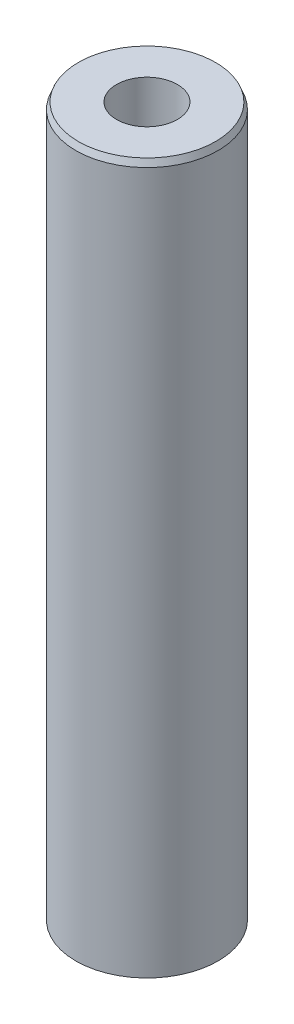
ISO-10303-21;
HEADER;
FILE_DESCRIPTION(('STEP AP214'),'2;1');
FILE_NAME('part.step','',(''),(''),'','','');
FILE_SCHEMA(('AUTOMOTIVE_DESIGN { 1 0 10303 214 1 1 1 1 }'));
ENDSEC;
DATA;
#1=APPLICATION_CONTEXT('core data for automotive mechanical design processes');
#2=APPLICATION_PROTOCOL_DEFINITION('international standard','automotive_design',2000,#1);
#3=PRODUCT_CONTEXT('',#1,'mechanical');
#4=PRODUCT('Part','Part','',(#3));
#5=PRODUCT_RELATED_PRODUCT_CATEGORY('part','',(#4));
#6=PRODUCT_DEFINITION_FORMATION('','',#4);
#7=PRODUCT_DEFINITION_CONTEXT('part definition',#1,'design');
#8=PRODUCT_DEFINITION('design','',#6,#7);
#9=PRODUCT_DEFINITION_SHAPE('','',#8);
#10=(LENGTH_UNIT() NAMED_UNIT(*) SI_UNIT(.MILLI.,.METRE.));
#11=(NAMED_UNIT(*) PLANE_ANGLE_UNIT() SI_UNIT($,.RADIAN.));
#12=(NAMED_UNIT(*) SI_UNIT($,.STERADIAN.) SOLID_ANGLE_UNIT());
#13=UNCERTAINTY_MEASURE_WITH_UNIT(LENGTH_MEASURE(1.E-05),#10,'distance_accuracy_value','');
#14=(GEOMETRIC_REPRESENTATION_CONTEXT(3) GLOBAL_UNCERTAINTY_ASSIGNED_CONTEXT((#13)) GLOBAL_UNIT_ASSIGNED_CONTEXT((#10,
#11,#12)) REPRESENTATION_CONTEXT('',''));
#15=CARTESIAN_POINT('',(0.,0.,0.));
#16=DIRECTION('',(0.,0.,1.));
#17=DIRECTION('',(1.,0.,0.));
#18=AXIS2_PLACEMENT_3D('',#15,#16,#17);
#19=CARTESIAN_POINT('',(0.,600.,0.));
#20=DIRECTION('',(0.,-1.,0.));
#21=DIRECTION('',(0.,0.,-1.));
#22=AXIS2_PLACEMENT_3D('',#19,#20,#21);
#23=CYLINDRICAL_SURFACE('',#22,60.);
#24=CARTESIAN_POINT('',(0.,594.459157099144,0.));
#25=DIRECTION('',(0.,1.,0.));
#26=DIRECTION('',(0.,0.,1.));
#27=AXIS2_PLACEMENT_3D('',#24,#25,#26);
#28=CIRCLE('',#27,60.);
#29=CARTESIAN_POINT('',(0.,594.459157099144,60.));
#30=VERTEX_POINT('',#29);
#31=EDGE_CURVE('E50',#30,#30,#28,.F.);
#32=ORIENTED_EDGE('',*,*,#31,.T.);
#33=EDGE_LOOP('',(#32));
#34=FACE_BOUND('',#33,.T.);
#35=CARTESIAN_POINT('',(0.,2.12822243041655,0.));
#36=DIRECTION('',(0.,1.,0.));
#37=DIRECTION('',(0.,0.,1.));
#38=AXIS2_PLACEMENT_3D('',#35,#36,#37);
#39=CIRCLE('',#38,60.);
#40=CARTESIAN_POINT('',(0.,2.12822243041655,60.));
#41=VERTEX_POINT('',#40);
#42=EDGE_CURVE('E51',#41,#41,#39,.T.);
#43=ORIENTED_EDGE('',*,*,#42,.T.);
#44=EDGE_LOOP('',(#43));
#45=FACE_BOUND('',#44,.T.);
#46=ADVANCED_FACE('F39',(#34,#45),#23,.T.);
#47=CARTESIAN_POINT('',(0.,600.,0.));
#48=DIRECTION('',(0.,1.,0.));
#49=DIRECTION('',(0.,0.,1.));
#50=AXIS2_PLACEMENT_3D('',#47,#48,#49);
#51=PLANE('',#50);
#52=CARTESIAN_POINT('',(0.,600.,0.));
#53=DIRECTION('',(0.,1.,0.));
#54=DIRECTION('',(0.,0.,1.));
#55=AXIS2_PLACEMENT_3D('',#52,#53,#54);
#56=CIRCLE('',#55,57.8717775695833);
#57=CARTESIAN_POINT('',(0.,600.,57.8717775695833));
#58=VERTEX_POINT('',#57);
#59=EDGE_CURVE('E54',#58,#58,#56,.T.);
#60=ORIENTED_EDGE('',*,*,#59,.T.);
#61=EDGE_LOOP('',(#60));
#62=FACE_BOUND('',#61,.T.);
#63=CARTESIAN_POINT('',(0.,600.,0.));
#64=DIRECTION('',(0.,1.,0.));
#65=DIRECTION('',(0.,0.,1.));
#66=AXIS2_PLACEMENT_3D('',#63,#64,#65);
#67=CIRCLE('',#66,25.6677594282875);
#68=CARTESIAN_POINT('',(0.,600.,25.6677594282875));
#69=VERTEX_POINT('',#68);
#70=EDGE_CURVE('E58',#69,#69,#67,.T.);
#71=ORIENTED_EDGE('',*,*,#70,.F.);
#72=EDGE_LOOP('',(#71));
#73=FACE_BOUND('',#72,.T.);
#74=ADVANCED_FACE('F69',(#62,#73),#51,.T.);
#75=CARTESIAN_POINT('',(0.,0.,0.));
#76=DIRECTION('',(0.,1.,0.));
#77=DIRECTION('',(0.,0.,1.));
#78=AXIS2_PLACEMENT_3D('',#75,#76,#77);
#79=PLANE('',#78);
#80=CARTESIAN_POINT('',(0.,0.,0.));
#81=DIRECTION('',(0.,1.,0.));
#82=DIRECTION('',(0.,0.,1.));
#83=AXIS2_PLACEMENT_3D('',#80,#81,#82);
#84=CIRCLE('',#83,54.4591570991444);
#85=CARTESIAN_POINT('',(0.,0.,54.4591570991444));
#86=VERTEX_POINT('',#85);
#87=EDGE_CURVE('E10',#86,#86,#84,.F.);
#88=ORIENTED_EDGE('',*,*,#87,.T.);
#89=EDGE_LOOP('',(#88));
#90=FACE_BOUND('',#89,.T.);
#91=CARTESIAN_POINT('',(0.,0.,0.));
#92=DIRECTION('',(0.,1.,0.));
#93=DIRECTION('',(0.,0.,1.));
#94=AXIS2_PLACEMENT_3D('',#91,#92,#93);
#95=CIRCLE('',#94,25.6677594282875);
#96=CARTESIAN_POINT('',(0.,0.,25.6677594282875));
#97=VERTEX_POINT('',#96);
#98=EDGE_CURVE('E63',#97,#97,#95,.T.);
#99=ORIENTED_EDGE('',*,*,#98,.T.);
#100=EDGE_LOOP('',(#99));
#101=FACE_BOUND('',#100,.T.);
#102=ADVANCED_FACE('F75',(#90,#101),#79,.F.);
#103=CARTESIAN_POINT('',(0.,600.,0.));
#104=DIRECTION('',(0.,-1.,0.));
#105=DIRECTION('',(0.,0.,-1.));
#106=AXIS2_PLACEMENT_3D('',#103,#104,#105);
#107=CYLINDRICAL_SURFACE('',#106,25.6677594282875);
#108=ORIENTED_EDGE('',*,*,#70,.T.);
#109=EDGE_LOOP('',(#108));
#110=FACE_BOUND('',#109,.T.);
#111=ORIENTED_EDGE('',*,*,#98,.F.);
#112=EDGE_LOOP('',(#111));
#113=FACE_BOUND('',#112,.T.);
#114=ADVANCED_FACE('F70',(#110,#113),#107,.F.);
#115=CARTESIAN_POINT('',(0.,600.,0.));
#116=DIRECTION('',(0.,-1.,0.));
#117=DIRECTION('',(0.,0.,-1.));
#118=AXIS2_PLACEMENT_3D('',#115,#116,#117);
#119=CONICAL_SURFACE('',#118,57.8717775695833,0.366722376555954);
#120=ORIENTED_EDGE('',*,*,#31,.F.);
#121=EDGE_LOOP('',(#120));
#122=FACE_BOUND('',#121,.T.);
#123=ORIENTED_EDGE('',*,*,#59,.F.);
#124=EDGE_LOOP('',(#123));
#125=FACE_BOUND('',#124,.T.);
#126=ADVANCED_FACE('F81',(#122,#125),#119,.T.);
#127=CARTESIAN_POINT('',(0.,2.12822243041655,0.));
#128=DIRECTION('',(0.,1.,0.));
#129=DIRECTION('',(0.,0.,1.));
#130=AXIS2_PLACEMENT_3D('',#127,#128,#129);
#131=CONICAL_SURFACE('',#130,60.,1.20407395023895);
#132=ORIENTED_EDGE('',*,*,#87,.F.);
#133=EDGE_LOOP('',(#132));
#134=FACE_BOUND('',#133,.T.);
#135=ORIENTED_EDGE('',*,*,#42,.F.);
#136=EDGE_LOOP('',(#135));
#137=FACE_BOUND('',#136,.T.);
#138=ADVANCED_FACE('F45',(#134,#137),#131,.T.);
#139=CLOSED_SHELL('',(#46,#74,#102,#114,#126,#138));
#140=MANIFOLD_SOLID_BREP('B2',#139);
#141=ADVANCED_BREP_SHAPE_REPRESENTATION('',(#18,#140),#14);
#142=SHAPE_DEFINITION_REPRESENTATION(#9,#141);
ENDSEC;
END-ISO-10303-21;
